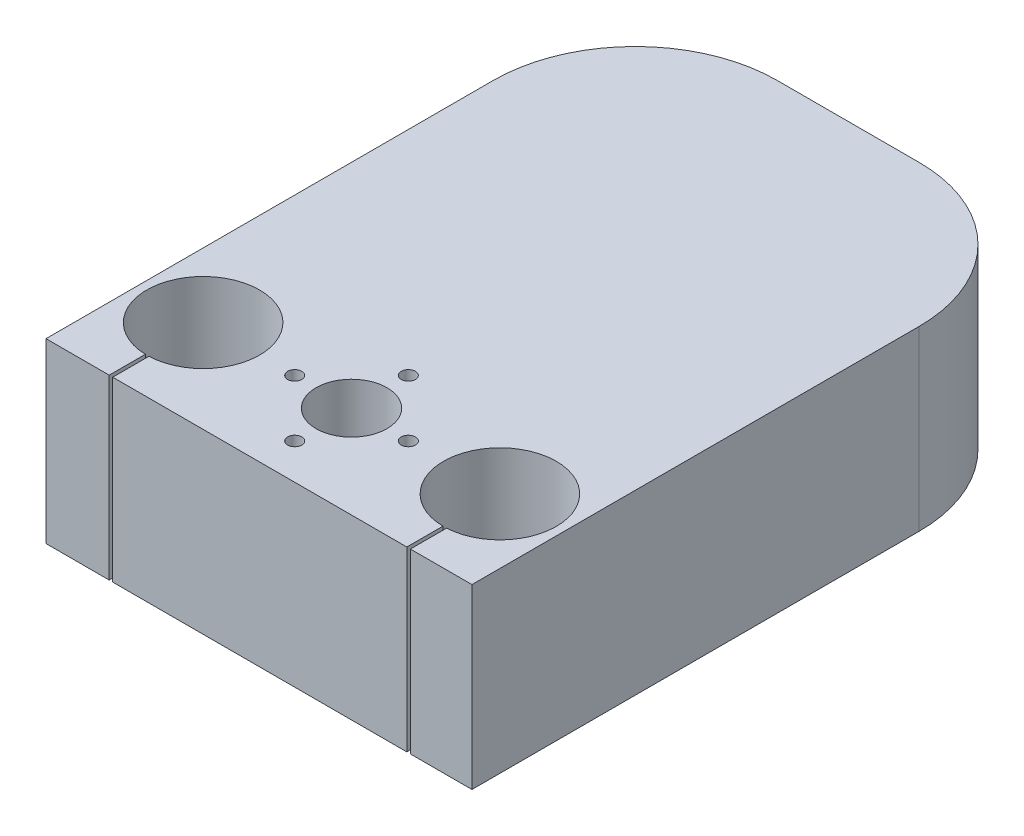
ISO-10303-21;
HEADER;
FILE_DESCRIPTION(('STEP AP214'),'2;1');
FILE_NAME('part.step','',(''),(''),'','','');
FILE_SCHEMA(('AUTOMOTIVE_DESIGN { 1 0 10303 214 1 1 1 1 }'));
ENDSEC;
DATA;
#1=APPLICATION_CONTEXT('core data for automotive mechanical design processes');
#2=APPLICATION_PROTOCOL_DEFINITION('international standard','automotive_design',2000,#1);
#3=PRODUCT_CONTEXT('',#1,'mechanical');
#4=PRODUCT('Part','Part','',(#3));
#5=PRODUCT_RELATED_PRODUCT_CATEGORY('part','',(#4));
#6=PRODUCT_DEFINITION_FORMATION('','',#4);
#7=PRODUCT_DEFINITION_CONTEXT('part definition',#1,'design');
#8=PRODUCT_DEFINITION('design','',#6,#7);
#9=PRODUCT_DEFINITION_SHAPE('','',#8);
#10=(LENGTH_UNIT() NAMED_UNIT(*) SI_UNIT(.MILLI.,.METRE.));
#11=(NAMED_UNIT(*) PLANE_ANGLE_UNIT() SI_UNIT($,.RADIAN.));
#12=(NAMED_UNIT(*) SI_UNIT($,.STERADIAN.) SOLID_ANGLE_UNIT());
#13=UNCERTAINTY_MEASURE_WITH_UNIT(LENGTH_MEASURE(1.E-05),#10,'distance_accuracy_value','');
#14=(GEOMETRIC_REPRESENTATION_CONTEXT(3) GLOBAL_UNCERTAINTY_ASSIGNED_CONTEXT((#13)) GLOBAL_UNIT_ASSIGNED_CONTEXT((#10,
#11,#12)) REPRESENTATION_CONTEXT('',''));
#15=CARTESIAN_POINT('',(0.,0.,0.));
#16=DIRECTION('',(0.,0.,1.));
#17=DIRECTION('',(1.,0.,0.));
#18=AXIS2_PLACEMENT_3D('',#15,#16,#17);
#19=CARTESIAN_POINT('',(0.,25.,0.));
#20=DIRECTION('',(0.,1.,0.));
#21=DIRECTION('',(0.,0.,1.));
#22=AXIS2_PLACEMENT_3D('',#19,#20,#21);
#23=PLANE('',#22);
#24=CARTESIAN_POINT('',(0.,25.,37.9648549593328));
#25=DIRECTION('',(0.,1.,0.));
#26=DIRECTION('',(0.,0.,1.));
#27=AXIS2_PLACEMENT_3D('',#24,#25,#26);
#28=CIRCLE('',#27,1.);
#29=CARTESIAN_POINT('',(0.,25.,38.9648549593328));
#30=VERTEX_POINT('',#29);
#31=EDGE_CURVE('E255',#30,#30,#28,.T.);
#32=ORIENTED_EDGE('',*,*,#31,.F.);
#33=EDGE_LOOP('',(#32));
#34=FACE_BOUND('',#33,.T.);
#35=CARTESIAN_POINT('',(7.99999999999994,25.,29.9648549593328));
#36=DIRECTION('',(0.,1.,0.));
#37=DIRECTION('',(0.,0.,1.));
#38=AXIS2_PLACEMENT_3D('',#35,#36,#37);
#39=CIRCLE('',#38,1.);
#40=CARTESIAN_POINT('',(7.99999999999994,25.,30.9648549593328));
#41=VERTEX_POINT('',#40);
#42=EDGE_CURVE('E246',#41,#41,#39,.T.);
#43=ORIENTED_EDGE('',*,*,#42,.F.);
#44=EDGE_LOOP('',(#43));
#45=FACE_BOUND('',#44,.T.);
#46=CARTESIAN_POINT('',(0.,25.,21.9648549593328));
#47=DIRECTION('',(0.,1.,0.));
#48=DIRECTION('',(0.,0.,1.));
#49=AXIS2_PLACEMENT_3D('',#46,#47,#48);
#50=CIRCLE('',#49,1.);
#51=CARTESIAN_POINT('',(0.,25.,22.9648549593328));
#52=VERTEX_POINT('',#51);
#53=EDGE_CURVE('E271',#52,#52,#50,.T.);
#54=ORIENTED_EDGE('',*,*,#53,.F.);
#55=EDGE_LOOP('',(#54));
#56=FACE_BOUND('',#55,.T.);
#57=CARTESIAN_POINT('',(-8.00000000000006,25.,29.9648549593328));
#58=DIRECTION('',(0.,1.,0.));
#59=DIRECTION('',(0.,0.,1.));
#60=AXIS2_PLACEMENT_3D('',#57,#58,#59);
#61=CIRCLE('',#60,1.);
#62=CARTESIAN_POINT('',(-8.00000000000006,25.,30.9648549593328));
#63=VERTEX_POINT('',#62);
#64=EDGE_CURVE('E262',#63,#63,#61,.T.);
#65=ORIENTED_EDGE('',*,*,#64,.F.);
#66=EDGE_LOOP('',(#65));
#67=FACE_BOUND('',#66,.T.);
#68=CARTESIAN_POINT('',(0.,25.,29.9648549593328));
#69=DIRECTION('',(0.,1.,0.));
#70=DIRECTION('',(0.,0.,1.));
#71=AXIS2_PLACEMENT_3D('',#68,#69,#70);
#72=CIRCLE('',#71,5.00000000000003);
#73=CARTESIAN_POINT('',(0.,25.,34.9648549593329));
#74=VERTEX_POINT('',#73);
#75=EDGE_CURVE('E238',#74,#74,#72,.T.);
#76=ORIENTED_EDGE('',*,*,#75,.F.);
#77=EDGE_LOOP('',(#76));
#78=FACE_BOUND('',#77,.T.);
#79=DIRECTION('',(-1.,0.,0.));
#80=VECTOR('',#79,1.);
#81=CARTESIAN_POINT('',(-30.,25.,43.));
#82=LINE('',#81,#80);
#83=CARTESIAN_POINT('',(20.8280771872218,25.,43.));
#84=VERTEX_POINT('',#83);
#85=CARTESIAN_POINT('',(-20.5987048663212,25.,43.));
#86=VERTEX_POINT('',#85);
#87=EDGE_CURVE('E213',#84,#86,#82,.T.);
#88=ORIENTED_EDGE('',*,*,#87,.F.);
#89=DIRECTION('',(0.,0.,1.));
#90=VECTOR('',#89,1.);
#91=CARTESIAN_POINT('',(20.8280771872218,25.,0.));
#92=LINE('',#91,#90);
#93=CARTESIAN_POINT('',(20.8280771872218,25.,37.9145296136192));
#94=VERTEX_POINT('',#93);
#95=EDGE_CURVE('E65',#94,#84,#92,.T.);
#96=ORIENTED_EDGE('',*,*,#95,.F.);
#97=CARTESIAN_POINT('',(20.9,25.,29.9648549593329));
#98=DIRECTION('',(0.,1.,0.));
#99=DIRECTION('',(0.,0.,1.));
#100=AXIS2_PLACEMENT_3D('',#97,#98,#99);
#101=CIRCLE('',#100,7.95);
#102=CARTESIAN_POINT('',(21.3280771872218,25.,37.9033214309998));
#103=VERTEX_POINT('',#102);
#104=EDGE_CURVE('E205',#103,#94,#101,.T.);
#105=ORIENTED_EDGE('',*,*,#104,.F.);
#106=DIRECTION('',(0.,0.,1.));
#107=VECTOR('',#106,1.);
#108=CARTESIAN_POINT('',(21.3280771872218,25.,0.));
#109=LINE('',#108,#107);
#110=CARTESIAN_POINT('',(21.3280771872218,25.,43.));
#111=VERTEX_POINT('',#110);
#112=EDGE_CURVE('E163',#103,#111,#109,.T.);
#113=ORIENTED_EDGE('',*,*,#112,.T.);
#114=CARTESIAN_POINT('',(30.,25.,43.));
#115=VERTEX_POINT('',#114);
#116=EDGE_CURVE('E203',#115,#111,#82,.T.);
#117=ORIENTED_EDGE('',*,*,#116,.F.);
#118=DIRECTION('',(0.,0.,-1.));
#119=VECTOR('',#118,1.);
#120=CARTESIAN_POINT('',(30.,25.,-40.));
#121=LINE('',#120,#119);
#122=CARTESIAN_POINT('',(30.,25.,-20.));
#123=VERTEX_POINT('',#122);
#124=EDGE_CURVE('E323',#115,#123,#121,.T.);
#125=ORIENTED_EDGE('',*,*,#124,.T.);
#126=CARTESIAN_POINT('',(10.,25.,-20.));
#127=DIRECTION('',(0.,1.,0.));
#128=DIRECTION('',(0.,0.,1.));
#129=AXIS2_PLACEMENT_3D('',#126,#127,#128);
#130=CIRCLE('',#129,20.);
#131=CARTESIAN_POINT('',(10.,25.,-40.));
#132=VERTEX_POINT('',#131);
#133=EDGE_CURVE('E357',#123,#132,#130,.T.);
#134=ORIENTED_EDGE('',*,*,#133,.T.);
#135=DIRECTION('',(-1.,0.,0.));
#136=VECTOR('',#135,1.);
#137=CARTESIAN_POINT('',(-30.,25.,-40.));
#138=LINE('',#137,#136);
#139=CARTESIAN_POINT('',(-9.99999999999999,25.,-40.));
#140=VERTEX_POINT('',#139);
#141=EDGE_CURVE('E326',#132,#140,#138,.T.);
#142=ORIENTED_EDGE('',*,*,#141,.T.);
#143=CARTESIAN_POINT('',(-9.99999999999999,25.,-20.));
#144=DIRECTION('',(0.,1.,0.));
#145=DIRECTION('',(0.,0.,1.));
#146=AXIS2_PLACEMENT_3D('',#143,#144,#145);
#147=CIRCLE('',#146,20.);
#148=CARTESIAN_POINT('',(-30.,25.,-20.));
#149=VERTEX_POINT('',#148);
#150=EDGE_CURVE('E360',#140,#149,#147,.T.);
#151=ORIENTED_EDGE('',*,*,#150,.T.);
#152=DIRECTION('',(0.,0.,1.));
#153=VECTOR('',#152,1.);
#154=CARTESIAN_POINT('',(-30.,25.,-40.));
#155=LINE('',#154,#153);
#156=CARTESIAN_POINT('',(-30.,25.,43.));
#157=VERTEX_POINT('',#156);
#158=EDGE_CURVE('E332',#149,#157,#155,.T.);
#159=ORIENTED_EDGE('',*,*,#158,.T.);
#160=CARTESIAN_POINT('',(-21.0987048663212,25.,43.));
#161=VERTEX_POINT('',#160);
#162=EDGE_CURVE('E215',#161,#157,#82,.T.);
#163=ORIENTED_EDGE('',*,*,#162,.F.);
#164=DIRECTION('',(0.,0.,1.));
#165=VECTOR('',#164,1.);
#166=CARTESIAN_POINT('',(-21.0987048663212,25.,36.9284074844018));
#167=LINE('',#166,#165);
#168=CARTESIAN_POINT('',(-21.0987048663212,25.,37.9123713245944));
#169=VERTEX_POINT('',#168);
#170=EDGE_CURVE('E57',#169,#161,#167,.T.);
#171=ORIENTED_EDGE('',*,*,#170,.F.);
#172=CARTESIAN_POINT('',(-20.9,25.,29.9648549593329));
#173=DIRECTION('',(0.,1.,0.));
#174=DIRECTION('',(0.,0.,1.));
#175=AXIS2_PLACEMENT_3D('',#172,#173,#174);
#176=CIRCLE('',#175,7.95);
#177=CARTESIAN_POINT('',(-20.5987048663212,25.,37.909143551927));
#178=VERTEX_POINT('',#177);
#179=EDGE_CURVE('E160',#178,#169,#176,.T.);
#180=ORIENTED_EDGE('',*,*,#179,.F.);
#181=DIRECTION('',(0.,0.,1.));
#182=VECTOR('',#181,1.);
#183=CARTESIAN_POINT('',(-20.5987048663212,25.,36.9284074844018));
#184=LINE('',#183,#182);
#185=EDGE_CURVE('E295',#178,#86,#184,.T.);
#186=ORIENTED_EDGE('',*,*,#185,.T.);
#187=EDGE_LOOP('',(#88,#96,#105,#113,#117,#125,#134,#142,#151,#159,#163,#171,#180,#186));
#188=FACE_BOUND('',#187,.T.);
#189=ADVANCED_FACE('F41',(#34,#45,#56,#67,#78,#188),#23,.T.);
#190=CARTESIAN_POINT('',(0.,0.,0.));
#191=DIRECTION('',(0.,1.,0.));
#192=DIRECTION('',(0.,0.,1.));
#193=AXIS2_PLACEMENT_3D('',#190,#191,#192);
#194=PLANE('',#193);
#195=CARTESIAN_POINT('',(0.,0.,29.9648549593328));
#196=DIRECTION('',(0.,1.,0.));
#197=DIRECTION('',(0.,0.,1.));
#198=AXIS2_PLACEMENT_3D('',#195,#196,#197);
#199=CIRCLE('',#198,5.00000000000003);
#200=CARTESIAN_POINT('',(0.,0.,34.9648549593329));
#201=VERTEX_POINT('',#200);
#202=EDGE_CURVE('E237',#201,#201,#199,.T.);
#203=ORIENTED_EDGE('',*,*,#202,.T.);
#204=EDGE_LOOP('',(#203));
#205=FACE_BOUND('',#204,.T.);
#206=CARTESIAN_POINT('',(-8.00000000000006,0.,29.9648549593328));
#207=DIRECTION('',(0.,1.,0.));
#208=DIRECTION('',(0.,0.,1.));
#209=AXIS2_PLACEMENT_3D('',#206,#207,#208);
#210=CIRCLE('',#209,1.);
#211=CARTESIAN_POINT('',(-8.00000000000006,0.,30.9648549593328));
#212=VERTEX_POINT('',#211);
#213=EDGE_CURVE('E266',#212,#212,#210,.T.);
#214=ORIENTED_EDGE('',*,*,#213,.T.);
#215=EDGE_LOOP('',(#214));
#216=FACE_BOUND('',#215,.T.);
#217=CARTESIAN_POINT('',(0.,0.,21.9648549593328));
#218=DIRECTION('',(0.,1.,0.));
#219=DIRECTION('',(0.,0.,1.));
#220=AXIS2_PLACEMENT_3D('',#217,#218,#219);
#221=CIRCLE('',#220,1.);
#222=CARTESIAN_POINT('',(0.,0.,22.9648549593328));
#223=VERTEX_POINT('',#222);
#224=EDGE_CURVE('E251',#223,#223,#221,.T.);
#225=ORIENTED_EDGE('',*,*,#224,.T.);
#226=EDGE_LOOP('',(#225));
#227=FACE_BOUND('',#226,.T.);
#228=CARTESIAN_POINT('',(7.99999999999994,0.,29.9648549593328));
#229=DIRECTION('',(0.,1.,0.));
#230=DIRECTION('',(0.,0.,1.));
#231=AXIS2_PLACEMENT_3D('',#228,#229,#230);
#232=CIRCLE('',#231,1.);
#233=CARTESIAN_POINT('',(7.99999999999994,0.,30.9648549593328));
#234=VERTEX_POINT('',#233);
#235=EDGE_CURVE('E250',#234,#234,#232,.T.);
#236=ORIENTED_EDGE('',*,*,#235,.T.);
#237=EDGE_LOOP('',(#236));
#238=FACE_BOUND('',#237,.T.);
#239=CARTESIAN_POINT('',(0.,0.,37.9648549593328));
#240=DIRECTION('',(0.,1.,0.));
#241=DIRECTION('',(0.,0.,1.));
#242=AXIS2_PLACEMENT_3D('',#239,#240,#241);
#243=CIRCLE('',#242,1.);
#244=CARTESIAN_POINT('',(0.,0.,38.9648549593328));
#245=VERTEX_POINT('',#244);
#246=EDGE_CURVE('E242',#245,#245,#243,.T.);
#247=ORIENTED_EDGE('',*,*,#246,.T.);
#248=EDGE_LOOP('',(#247));
#249=FACE_BOUND('',#248,.T.);
#250=CARTESIAN_POINT('',(0.261411620152308,0.,-23.5192851424782));
#251=DIRECTION('',(0.,-1.,0.));
#252=DIRECTION('',(0.,0.,-1.));
#253=AXIS2_PLACEMENT_3D('',#250,#251,#252);
#254=CIRCLE('',#253,2.5);
#255=CARTESIAN_POINT('',(0.261411620152308,0.,-26.0192851424782));
#256=VERTEX_POINT('',#255);
#257=EDGE_CURVE('E278',#256,#256,#254,.T.);
#258=ORIENTED_EDGE('',*,*,#257,.F.);
#259=EDGE_LOOP('',(#258));
#260=FACE_BOUND('',#259,.T.);
#261=DIRECTION('',(0.,0.,1.));
#262=VECTOR('',#261,1.);
#263=CARTESIAN_POINT('',(20.8280771872218,0.,0.));
#264=LINE('',#263,#262);
#265=CARTESIAN_POINT('',(20.8280771872218,0.,37.9145296136192));
#266=VERTEX_POINT('',#265);
#267=CARTESIAN_POINT('',(20.8280771872218,0.,43.));
#268=VERTEX_POINT('',#267);
#269=EDGE_CURVE('E150',#266,#268,#264,.T.);
#270=ORIENTED_EDGE('',*,*,#269,.T.);
#271=DIRECTION('',(1.,0.,0.));
#272=VECTOR('',#271,1.);
#273=CARTESIAN_POINT('',(-30.,0.,43.));
#274=LINE('',#273,#272);
#275=CARTESIAN_POINT('',(-20.5987048663212,0.,43.));
#276=VERTEX_POINT('',#275);
#277=EDGE_CURVE('E230',#276,#268,#274,.T.);
#278=ORIENTED_EDGE('',*,*,#277,.F.);
#279=DIRECTION('',(0.,0.,1.));
#280=VECTOR('',#279,1.);
#281=CARTESIAN_POINT('',(-20.5987048663212,0.,36.9284074844018));
#282=LINE('',#281,#280);
#283=CARTESIAN_POINT('',(-20.5987048663212,0.,37.909143551927));
#284=VERTEX_POINT('',#283);
#285=EDGE_CURVE('E151',#284,#276,#282,.T.);
#286=ORIENTED_EDGE('',*,*,#285,.F.);
#287=CARTESIAN_POINT('',(-20.9,0.,29.9648549593329));
#288=DIRECTION('',(0.,1.,0.));
#289=DIRECTION('',(0.,0.,1.));
#290=AXIS2_PLACEMENT_3D('',#287,#288,#289);
#291=CIRCLE('',#290,7.95);
#292=CARTESIAN_POINT('',(-21.0987048663212,0.,37.9123713245944));
#293=VERTEX_POINT('',#292);
#294=EDGE_CURVE('E158',#284,#293,#291,.T.);
#295=ORIENTED_EDGE('',*,*,#294,.T.);
#296=DIRECTION('',(0.,0.,1.));
#297=VECTOR('',#296,1.);
#298=CARTESIAN_POINT('',(-21.0987048663212,0.,36.9284074844018));
#299=LINE('',#298,#297);
#300=CARTESIAN_POINT('',(-21.0987048663212,0.,43.));
#301=VERTEX_POINT('',#300);
#302=EDGE_CURVE('E140',#293,#301,#299,.T.);
#303=ORIENTED_EDGE('',*,*,#302,.T.);
#304=CARTESIAN_POINT('',(-30.,0.,43.));
#305=VERTEX_POINT('',#304);
#306=EDGE_CURVE('E228',#305,#301,#274,.T.);
#307=ORIENTED_EDGE('',*,*,#306,.F.);
#308=DIRECTION('',(0.,0.,1.));
#309=VECTOR('',#308,1.);
#310=CARTESIAN_POINT('',(-30.,0.,-40.));
#311=LINE('',#310,#309);
#312=CARTESIAN_POINT('',(-30.,0.,-20.));
#313=VERTEX_POINT('',#312);
#314=EDGE_CURVE('E327',#313,#305,#311,.T.);
#315=ORIENTED_EDGE('',*,*,#314,.F.);
#316=CARTESIAN_POINT('',(-9.99999999999999,0.,-20.));
#317=DIRECTION('',(0.,1.,0.));
#318=DIRECTION('',(0.,0.,1.));
#319=AXIS2_PLACEMENT_3D('',#316,#317,#318);
#320=CIRCLE('',#319,20.);
#321=CARTESIAN_POINT('',(-9.99999999999999,0.,-40.));
#322=VERTEX_POINT('',#321);
#323=EDGE_CURVE('E347',#313,#322,#320,.F.);
#324=ORIENTED_EDGE('',*,*,#323,.T.);
#325=DIRECTION('',(-1.,0.,0.));
#326=VECTOR('',#325,1.);
#327=CARTESIAN_POINT('',(-30.,0.,-40.));
#328=LINE('',#327,#326);
#329=CARTESIAN_POINT('',(10.,0.,-40.));
#330=VERTEX_POINT('',#329);
#331=EDGE_CURVE('E176',#330,#322,#328,.T.);
#332=ORIENTED_EDGE('',*,*,#331,.F.);
#333=CARTESIAN_POINT('',(10.,0.,-20.));
#334=DIRECTION('',(0.,1.,0.));
#335=DIRECTION('',(0.,0.,1.));
#336=AXIS2_PLACEMENT_3D('',#333,#334,#335);
#337=CIRCLE('',#336,20.);
#338=CARTESIAN_POINT('',(30.,0.,-20.));
#339=VERTEX_POINT('',#338);
#340=EDGE_CURVE('E319',#330,#339,#337,.F.);
#341=ORIENTED_EDGE('',*,*,#340,.T.);
#342=DIRECTION('',(0.,0.,-1.));
#343=VECTOR('',#342,1.);
#344=CARTESIAN_POINT('',(30.,0.,-40.));
#345=LINE('',#344,#343);
#346=CARTESIAN_POINT('',(30.,0.,43.));
#347=VERTEX_POINT('',#346);
#348=EDGE_CURVE('E170',#347,#339,#345,.T.);
#349=ORIENTED_EDGE('',*,*,#348,.F.);
#350=CARTESIAN_POINT('',(21.3280771872218,0.,43.));
#351=VERTEX_POINT('',#350);
#352=EDGE_CURVE('E232',#351,#347,#274,.T.);
#353=ORIENTED_EDGE('',*,*,#352,.F.);
#354=DIRECTION('',(0.,0.,1.));
#355=VECTOR('',#354,1.);
#356=CARTESIAN_POINT('',(21.3280771872218,0.,0.));
#357=LINE('',#356,#355);
#358=CARTESIAN_POINT('',(21.3280771872218,0.,37.9033214309998));
#359=VERTEX_POINT('',#358);
#360=EDGE_CURVE('E194',#359,#351,#357,.T.);
#361=ORIENTED_EDGE('',*,*,#360,.F.);
#362=CARTESIAN_POINT('',(20.9,0.,29.9648549593329));
#363=DIRECTION('',(0.,1.,0.));
#364=DIRECTION('',(0.,0.,1.));
#365=AXIS2_PLACEMENT_3D('',#362,#363,#364);
#366=CIRCLE('',#365,7.95);
#367=EDGE_CURVE('E171',#359,#266,#366,.T.);
#368=ORIENTED_EDGE('',*,*,#367,.T.);
#369=EDGE_LOOP('',(#270,#278,#286,#295,#303,#307,#315,#324,#332,#341,#349,#353,#361,#368));
#370=FACE_BOUND('',#369,.T.);
#371=ADVANCED_FACE('F167',(#205,#216,#227,#238,#249,#260,#370),#194,.F.);
#372=CARTESIAN_POINT('',(20.9,-10.,29.9648549593329));
#373=DIRECTION('',(0.,1.,0.));
#374=DIRECTION('',(0.,0.,1.));
#375=AXIS2_PLACEMENT_3D('',#372,#373,#374);
#376=CYLINDRICAL_SURFACE('',#375,7.95);
#377=DIRECTION('',(0.,1.,0.));
#378=VECTOR('',#377,1.);
#379=CARTESIAN_POINT('',(20.8280771872218,-10.,37.9145296136192));
#380=LINE('',#379,#378);
#381=EDGE_CURVE('E282',#266,#94,#380,.T.);
#382=ORIENTED_EDGE('',*,*,#381,.F.);
#383=ORIENTED_EDGE('',*,*,#367,.F.);
#384=DIRECTION('',(0.,1.,0.));
#385=VECTOR('',#384,1.);
#386=CARTESIAN_POINT('',(21.3280771872218,-10.,37.9033214309998));
#387=LINE('',#386,#385);
#388=EDGE_CURVE('E288',#359,#103,#387,.T.);
#389=ORIENTED_EDGE('',*,*,#388,.T.);
#390=ORIENTED_EDGE('',*,*,#104,.T.);
#391=EDGE_LOOP('',(#382,#383,#389,#390));
#392=FACE_BOUND('',#391,.T.);
#393=ADVANCED_FACE('F316',(#392),#376,.F.);
#394=CARTESIAN_POINT('',(0.,0.,43.));
#395=DIRECTION('',(0.,0.,1.));
#396=DIRECTION('',(1.,0.,0.));
#397=AXIS2_PLACEMENT_3D('',#394,#395,#396);
#398=PLANE('',#397);
#399=ORIENTED_EDGE('',*,*,#277,.T.);
#400=DIRECTION('',(0.,1.,0.));
#401=VECTOR('',#400,1.);
#402=CARTESIAN_POINT('',(20.8280771872218,0.,43.));
#403=LINE('',#402,#401);
#404=EDGE_CURVE('E11',#268,#84,#403,.T.);
#405=ORIENTED_EDGE('',*,*,#404,.T.);
#406=ORIENTED_EDGE('',*,*,#87,.T.);
#407=DIRECTION('',(0.,1.,0.));
#408=VECTOR('',#407,1.);
#409=CARTESIAN_POINT('',(-20.5987048663212,0.,43.));
#410=LINE('',#409,#408);
#411=EDGE_CURVE('E184',#276,#86,#410,.T.);
#412=ORIENTED_EDGE('',*,*,#411,.F.);
#413=EDGE_LOOP('',(#399,#405,#406,#412));
#414=FACE_BOUND('',#413,.T.);
#415=ADVANCED_FACE('F311',(#414),#398,.T.);
#416=ORIENTED_EDGE('',*,*,#306,.T.);
#417=DIRECTION('',(0.,1.,0.));
#418=VECTOR('',#417,1.);
#419=CARTESIAN_POINT('',(-21.0987048663212,0.,43.));
#420=LINE('',#419,#418);
#421=EDGE_CURVE('E144',#301,#161,#420,.T.);
#422=ORIENTED_EDGE('',*,*,#421,.T.);
#423=ORIENTED_EDGE('',*,*,#162,.T.);
#424=DIRECTION('',(0.,-1.,0.));
#425=VECTOR('',#424,1.);
#426=CARTESIAN_POINT('',(-30.,25.,43.));
#427=LINE('',#426,#425);
#428=EDGE_CURVE('E234',#157,#305,#427,.T.);
#429=ORIENTED_EDGE('',*,*,#428,.T.);
#430=EDGE_LOOP('',(#416,#422,#423,#429));
#431=FACE_BOUND('',#430,.T.);
#432=ADVANCED_FACE('F401',(#431),#398,.T.);
#433=CARTESIAN_POINT('',(30.,25.,-40.));
#434=DIRECTION('',(-1.,0.,0.));
#435=DIRECTION('',(0.,0.,1.));
#436=AXIS2_PLACEMENT_3D('',#433,#434,#435);
#437=PLANE('',#436);
#438=ORIENTED_EDGE('',*,*,#348,.T.);
#439=DIRECTION('',(0.,-1.,0.));
#440=VECTOR('',#439,1.);
#441=CARTESIAN_POINT('',(30.,25.,-20.));
#442=LINE('',#441,#440);
#443=EDGE_CURVE('E185',#339,#123,#442,.F.);
#444=ORIENTED_EDGE('',*,*,#443,.T.);
#445=ORIENTED_EDGE('',*,*,#124,.F.);
#446=DIRECTION('',(0.,1.,0.));
#447=VECTOR('',#446,1.);
#448=CARTESIAN_POINT('',(30.,25.,43.));
#449=LINE('',#448,#447);
#450=EDGE_CURVE('E211',#347,#115,#449,.T.);
#451=ORIENTED_EDGE('',*,*,#450,.F.);
#452=EDGE_LOOP('',(#438,#444,#445,#451));
#453=FACE_BOUND('',#452,.T.);
#454=ADVANCED_FACE('F322',(#453),#437,.F.);
#455=CARTESIAN_POINT('',(-30.,25.,-40.));
#456=DIRECTION('',(0.,0.,1.));
#457=DIRECTION('',(1.,0.,0.));
#458=AXIS2_PLACEMENT_3D('',#455,#456,#457);
#459=PLANE('',#458);
#460=ORIENTED_EDGE('',*,*,#331,.T.);
#461=DIRECTION('',(0.,-1.,0.));
#462=VECTOR('',#461,1.);
#463=CARTESIAN_POINT('',(-9.99999999999999,25.,-40.));
#464=LINE('',#463,#462);
#465=EDGE_CURVE('E354',#322,#140,#464,.F.);
#466=ORIENTED_EDGE('',*,*,#465,.T.);
#467=ORIENTED_EDGE('',*,*,#141,.F.);
#468=DIRECTION('',(0.,-1.,0.));
#469=VECTOR('',#468,1.);
#470=CARTESIAN_POINT('',(10.,25.,-40.));
#471=LINE('',#470,#469);
#472=EDGE_CURVE('E350',#132,#330,#471,.T.);
#473=ORIENTED_EDGE('',*,*,#472,.T.);
#474=EDGE_LOOP('',(#460,#466,#467,#473));
#475=FACE_BOUND('',#474,.T.);
#476=ADVANCED_FACE('F375',(#475),#459,.F.);
#477=CARTESIAN_POINT('',(-30.,25.,-40.));
#478=DIRECTION('',(1.,0.,0.));
#479=DIRECTION('',(0.,0.,-1.));
#480=AXIS2_PLACEMENT_3D('',#477,#478,#479);
#481=PLANE('',#480);
#482=ORIENTED_EDGE('',*,*,#158,.F.);
#483=DIRECTION('',(0.,-1.,0.));
#484=VECTOR('',#483,1.);
#485=CARTESIAN_POINT('',(-30.,25.,-20.));
#486=LINE('',#485,#484);
#487=EDGE_CURVE('E337',#149,#313,#486,.T.);
#488=ORIENTED_EDGE('',*,*,#487,.T.);
#489=ORIENTED_EDGE('',*,*,#314,.T.);
#490=ORIENTED_EDGE('',*,*,#428,.F.);
#491=EDGE_LOOP('',(#482,#488,#489,#490));
#492=FACE_BOUND('',#491,.T.);
#493=ADVANCED_FACE('F371',(#492),#481,.F.);
#494=CARTESIAN_POINT('',(-9.99999999999999,25.,-20.));
#495=DIRECTION('',(0.,-1.,0.));
#496=DIRECTION('',(0.,0.,-1.));
#497=AXIS2_PLACEMENT_3D('',#494,#495,#496);
#498=CYLINDRICAL_SURFACE('',#497,20.);
#499=ORIENTED_EDGE('',*,*,#150,.F.);
#500=ORIENTED_EDGE('',*,*,#465,.F.);
#501=ORIENTED_EDGE('',*,*,#323,.F.);
#502=ORIENTED_EDGE('',*,*,#487,.F.);
#503=EDGE_LOOP('',(#499,#500,#501,#502));
#504=FACE_BOUND('',#503,.T.);
#505=ADVANCED_FACE('F373',(#504),#498,.T.);
#506=CARTESIAN_POINT('',(10.,25.,-20.));
#507=DIRECTION('',(0.,-1.,0.));
#508=DIRECTION('',(0.,0.,-1.));
#509=AXIS2_PLACEMENT_3D('',#506,#507,#508);
#510=CYLINDRICAL_SURFACE('',#509,20.);
#511=ORIENTED_EDGE('',*,*,#133,.F.);
#512=ORIENTED_EDGE('',*,*,#443,.F.);
#513=ORIENTED_EDGE('',*,*,#340,.F.);
#514=ORIENTED_EDGE('',*,*,#472,.F.);
#515=EDGE_LOOP('',(#511,#512,#513,#514));
#516=FACE_BOUND('',#515,.T.);
#517=ADVANCED_FACE('F43',(#516),#510,.T.);
#518=CARTESIAN_POINT('',(-20.9,-10.,29.9648549593329));
#519=DIRECTION('',(0.,1.,0.));
#520=DIRECTION('',(0.,0.,1.));
#521=AXIS2_PLACEMENT_3D('',#518,#519,#520);
#522=CYLINDRICAL_SURFACE('',#521,7.95);
#523=ORIENTED_EDGE('',*,*,#294,.F.);
#524=DIRECTION('',(0.,1.,0.));
#525=VECTOR('',#524,1.);
#526=CARTESIAN_POINT('',(-20.5987048663212,-10.,37.909143551927));
#527=LINE('',#526,#525);
#528=EDGE_CURVE('E162',#284,#178,#527,.T.);
#529=ORIENTED_EDGE('',*,*,#528,.T.);
#530=ORIENTED_EDGE('',*,*,#179,.T.);
#531=DIRECTION('',(0.,1.,0.));
#532=VECTOR('',#531,1.);
#533=CARTESIAN_POINT('',(-21.0987048663212,-10.,37.9123713245944));
#534=LINE('',#533,#532);
#535=EDGE_CURVE('E143',#293,#169,#534,.T.);
#536=ORIENTED_EDGE('',*,*,#535,.F.);
#537=EDGE_LOOP('',(#523,#529,#530,#536));
#538=FACE_BOUND('',#537,.T.);
#539=ADVANCED_FACE('F156',(#538),#522,.F.);
#540=DIRECTION('',(0.,1.,0.));
#541=VECTOR('',#540,1.);
#542=CARTESIAN_POINT('',(21.3280771872218,0.,43.));
#543=LINE('',#542,#541);
#544=EDGE_CURVE('E50',#351,#111,#543,.T.);
#545=ORIENTED_EDGE('',*,*,#544,.F.);
#546=ORIENTED_EDGE('',*,*,#352,.T.);
#547=ORIENTED_EDGE('',*,*,#450,.T.);
#548=ORIENTED_EDGE('',*,*,#116,.T.);
#549=EDGE_LOOP('',(#545,#546,#547,#548));
#550=FACE_BOUND('',#549,.T.);
#551=ADVANCED_FACE('F209',(#550),#398,.T.);
#552=CARTESIAN_POINT('',(0.,0.,29.9648549593328));
#553=DIRECTION('',(0.,1.,0.));
#554=DIRECTION('',(0.,0.,1.));
#555=AXIS2_PLACEMENT_3D('',#552,#553,#554);
#556=CYLINDRICAL_SURFACE('',#555,5.00000000000003);
#557=ORIENTED_EDGE('',*,*,#202,.F.);
#558=EDGE_LOOP('',(#557));
#559=FACE_BOUND('',#558,.T.);
#560=ORIENTED_EDGE('',*,*,#75,.T.);
#561=EDGE_LOOP('',(#560));
#562=FACE_BOUND('',#561,.T.);
#563=ADVANCED_FACE('F411',(#559,#562),#556,.F.);
#564=CARTESIAN_POINT('',(-8.00000000000006,0.,29.9648549593328));
#565=DIRECTION('',(0.,1.,0.));
#566=DIRECTION('',(0.,0.,1.));
#567=AXIS2_PLACEMENT_3D('',#564,#565,#566);
#568=CYLINDRICAL_SURFACE('',#567,1.);
#569=ORIENTED_EDGE('',*,*,#213,.F.);
#570=EDGE_LOOP('',(#569));
#571=FACE_BOUND('',#570,.T.);
#572=ORIENTED_EDGE('',*,*,#64,.T.);
#573=EDGE_LOOP('',(#572));
#574=FACE_BOUND('',#573,.T.);
#575=ADVANCED_FACE('F415',(#571,#574),#568,.F.);
#576=CARTESIAN_POINT('',(0.,0.,21.9648549593328));
#577=DIRECTION('',(0.,1.,0.));
#578=DIRECTION('',(0.,0.,1.));
#579=AXIS2_PLACEMENT_3D('',#576,#577,#578);
#580=CYLINDRICAL_SURFACE('',#579,1.);
#581=ORIENTED_EDGE('',*,*,#224,.F.);
#582=EDGE_LOOP('',(#581));
#583=FACE_BOUND('',#582,.T.);
#584=ORIENTED_EDGE('',*,*,#53,.T.);
#585=EDGE_LOOP('',(#584));
#586=FACE_BOUND('',#585,.T.);
#587=ADVANCED_FACE('F420',(#583,#586),#580,.F.);
#588=CARTESIAN_POINT('',(7.99999999999994,0.,29.9648549593328));
#589=DIRECTION('',(0.,1.,0.));
#590=DIRECTION('',(0.,0.,1.));
#591=AXIS2_PLACEMENT_3D('',#588,#589,#590);
#592=CYLINDRICAL_SURFACE('',#591,1.);
#593=ORIENTED_EDGE('',*,*,#235,.F.);
#594=EDGE_LOOP('',(#593));
#595=FACE_BOUND('',#594,.T.);
#596=ORIENTED_EDGE('',*,*,#42,.T.);
#597=EDGE_LOOP('',(#596));
#598=FACE_BOUND('',#597,.T.);
#599=ADVANCED_FACE('F426',(#595,#598),#592,.F.);
#600=CARTESIAN_POINT('',(0.,0.,37.9648549593328));
#601=DIRECTION('',(0.,1.,0.));
#602=DIRECTION('',(0.,0.,1.));
#603=AXIS2_PLACEMENT_3D('',#600,#601,#602);
#604=CYLINDRICAL_SURFACE('',#603,1.);
#605=ORIENTED_EDGE('',*,*,#246,.F.);
#606=EDGE_LOOP('',(#605));
#607=FACE_BOUND('',#606,.T.);
#608=ORIENTED_EDGE('',*,*,#31,.T.);
#609=EDGE_LOOP('',(#608));
#610=FACE_BOUND('',#609,.T.);
#611=ADVANCED_FACE('F429',(#607,#610),#604,.F.);
#612=CARTESIAN_POINT('',(0.261411620152308,15.,-23.5192851424782));
#613=DIRECTION('',(0.,-1.,0.));
#614=DIRECTION('',(0.,0.,-1.));
#615=AXIS2_PLACEMENT_3D('',#612,#613,#614);
#616=CYLINDRICAL_SURFACE('',#615,2.5);
#617=CARTESIAN_POINT('',(0.261411620152308,15.,-23.5192851424782));
#618=DIRECTION('',(0.,-1.,0.));
#619=DIRECTION('',(0.,0.,-1.));
#620=AXIS2_PLACEMENT_3D('',#617,#618,#619);
#621=CIRCLE('',#620,2.5);
#622=CARTESIAN_POINT('',(0.261411620152308,15.,-26.0192851424782));
#623=VERTEX_POINT('',#622);
#624=EDGE_CURVE('E267',#623,#623,#621,.T.);
#625=ORIENTED_EDGE('',*,*,#624,.F.);
#626=EDGE_LOOP('',(#625));
#627=FACE_BOUND('',#626,.T.);
#628=ORIENTED_EDGE('',*,*,#257,.T.);
#629=EDGE_LOOP('',(#628));
#630=FACE_BOUND('',#629,.T.);
#631=ADVANCED_FACE('F432',(#627,#630),#616,.F.);
#632=CARTESIAN_POINT('',(0.261411620152308,15.,-23.5192851424782));
#633=DIRECTION('',(0.,-1.,0.));
#634=DIRECTION('',(0.,0.,-1.));
#635=AXIS2_PLACEMENT_3D('',#632,#633,#634);
#636=PLANE('',#635);
#637=ORIENTED_EDGE('',*,*,#624,.T.);
#638=EDGE_LOOP('',(#637));
#639=FACE_BOUND('',#638,.T.);
#640=ADVANCED_FACE('F440',(#639),#636,.T.);
#641=CARTESIAN_POINT('',(-21.0987048663212,25.,36.9284074844018));
#642=DIRECTION('',(1.,0.,0.));
#643=DIRECTION('',(0.,0.,-1.));
#644=AXIS2_PLACEMENT_3D('',#641,#642,#643);
#645=PLANE('',#644);
#646=ORIENTED_EDGE('',*,*,#535,.T.);
#647=ORIENTED_EDGE('',*,*,#170,.T.);
#648=ORIENTED_EDGE('',*,*,#421,.F.);
#649=ORIENTED_EDGE('',*,*,#302,.F.);
#650=EDGE_LOOP('',(#646,#647,#648,#649));
#651=FACE_BOUND('',#650,.T.);
#652=ADVANCED_FACE('F142',(#651),#645,.T.);
#653=CARTESIAN_POINT('',(-20.5987048663212,25.,36.9284074844018));
#654=DIRECTION('',(1.,0.,0.));
#655=DIRECTION('',(0.,0.,-1.));
#656=AXIS2_PLACEMENT_3D('',#653,#654,#655);
#657=PLANE('',#656);
#658=ORIENTED_EDGE('',*,*,#285,.T.);
#659=ORIENTED_EDGE('',*,*,#411,.T.);
#660=ORIENTED_EDGE('',*,*,#185,.F.);
#661=ORIENTED_EDGE('',*,*,#528,.F.);
#662=EDGE_LOOP('',(#658,#659,#660,#661));
#663=FACE_BOUND('',#662,.T.);
#664=ADVANCED_FACE('F445',(#663),#657,.F.);
#665=CARTESIAN_POINT('',(21.3280771872218,25.,0.));
#666=DIRECTION('',(1.,0.,0.));
#667=DIRECTION('',(0.,0.,-1.));
#668=AXIS2_PLACEMENT_3D('',#665,#666,#667);
#669=PLANE('',#668);
#670=ORIENTED_EDGE('',*,*,#360,.T.);
#671=ORIENTED_EDGE('',*,*,#544,.T.);
#672=ORIENTED_EDGE('',*,*,#112,.F.);
#673=ORIENTED_EDGE('',*,*,#388,.F.);
#674=EDGE_LOOP('',(#670,#671,#672,#673));
#675=FACE_BOUND('',#674,.T.);
#676=ADVANCED_FACE('F191',(#675),#669,.F.);
#677=CARTESIAN_POINT('',(20.8280771872218,25.,0.));
#678=DIRECTION('',(1.,0.,0.));
#679=DIRECTION('',(0.,0.,-1.));
#680=AXIS2_PLACEMENT_3D('',#677,#678,#679);
#681=PLANE('',#680);
#682=ORIENTED_EDGE('',*,*,#381,.T.);
#683=ORIENTED_EDGE('',*,*,#95,.T.);
#684=ORIENTED_EDGE('',*,*,#404,.F.);
#685=ORIENTED_EDGE('',*,*,#269,.F.);
#686=EDGE_LOOP('',(#682,#683,#684,#685));
#687=FACE_BOUND('',#686,.T.);
#688=ADVANCED_FACE('F314',(#687),#681,.T.);
#689=CLOSED_SHELL('',(#189,#371,#393,#415,#432,#454,#476,#493,#505,#517,#539,#551,#563,#575,
#587,#599,#611,#631,#640,#652,#664,#676,#688));
#690=MANIFOLD_SOLID_BREP('B2',#689);
#691=ADVANCED_BREP_SHAPE_REPRESENTATION('',(#18,#690),#14);
#692=SHAPE_DEFINITION_REPRESENTATION(#9,#691);
ENDSEC;
END-ISO-10303-21;
